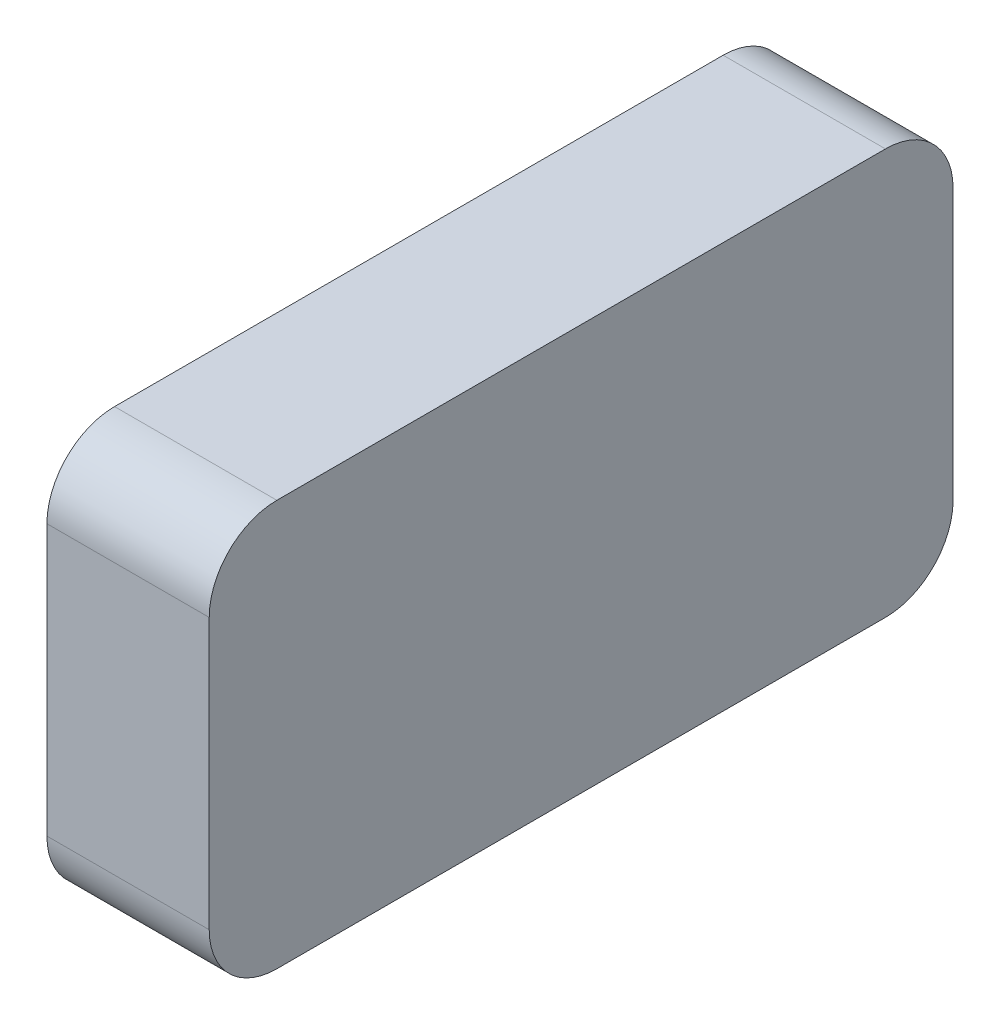
ISO-10303-21;
HEADER;
FILE_DESCRIPTION(('STEP AP214'),'2;1');
FILE_NAME('part.step','',(''),(''),'','','');
FILE_SCHEMA(('AUTOMOTIVE_DESIGN { 1 0 10303 214 1 1 1 1 }'));
ENDSEC;
DATA;
#1=APPLICATION_CONTEXT('core data for automotive mechanical design processes');
#2=APPLICATION_PROTOCOL_DEFINITION('international standard','automotive_design',2000,#1);
#3=PRODUCT_CONTEXT('',#1,'mechanical');
#4=PRODUCT('Part','Part','',(#3));
#5=PRODUCT_RELATED_PRODUCT_CATEGORY('part','',(#4));
#6=PRODUCT_DEFINITION_FORMATION('','',#4);
#7=PRODUCT_DEFINITION_CONTEXT('part definition',#1,'design');
#8=PRODUCT_DEFINITION('design','',#6,#7);
#9=PRODUCT_DEFINITION_SHAPE('','',#8);
#10=(LENGTH_UNIT() NAMED_UNIT(*) SI_UNIT(.MILLI.,.METRE.));
#11=(NAMED_UNIT(*) PLANE_ANGLE_UNIT() SI_UNIT($,.RADIAN.));
#12=(NAMED_UNIT(*) SI_UNIT($,.STERADIAN.) SOLID_ANGLE_UNIT());
#13=UNCERTAINTY_MEASURE_WITH_UNIT(LENGTH_MEASURE(1.E-05),#10,'distance_accuracy_value','');
#14=(GEOMETRIC_REPRESENTATION_CONTEXT(3) GLOBAL_UNCERTAINTY_ASSIGNED_CONTEXT((#13)) GLOBAL_UNIT_ASSIGNED_CONTEXT((#10,
#11,#12)) REPRESENTATION_CONTEXT('',''));
#15=CARTESIAN_POINT('',(0.,0.,0.));
#16=DIRECTION('',(0.,0.,1.));
#17=DIRECTION('',(1.,0.,0.));
#18=AXIS2_PLACEMENT_3D('',#15,#16,#17);
#19=CARTESIAN_POINT('',(12.,10.,-22.5));
#20=DIRECTION('',(-1.,0.,0.));
#21=DIRECTION('',(0.,0.,1.));
#22=AXIS2_PLACEMENT_3D('',#19,#20,#21);
#23=CYLINDRICAL_SURFACE('',#22,5.);
#24=CARTESIAN_POINT('',(0.,10.,-22.5));
#25=DIRECTION('',(1.,0.,0.));
#26=DIRECTION('',(0.,0.,1.));
#27=AXIS2_PLACEMENT_3D('',#24,#25,#26);
#28=CIRCLE('',#27,5.);
#29=CARTESIAN_POINT('',(0.,9.99999999999996,-27.5));
#30=VERTEX_POINT('',#29);
#31=CARTESIAN_POINT('',(0.,15.,-22.5));
#32=VERTEX_POINT('',#31);
#33=EDGE_CURVE('E137',#30,#32,#28,.T.);
#34=ORIENTED_EDGE('',*,*,#33,.T.);
#35=DIRECTION('',(-1.,0.,0.));
#36=VECTOR('',#35,1.);
#37=CARTESIAN_POINT('',(12.,15.,-22.5));
#38=LINE('',#37,#36);
#39=CARTESIAN_POINT('',(12.,15.,-22.5));
#40=VERTEX_POINT('',#39);
#41=EDGE_CURVE('E11',#40,#32,#38,.T.);
#42=ORIENTED_EDGE('',*,*,#41,.F.);
#43=CARTESIAN_POINT('',(12.,10.,-22.5));
#44=DIRECTION('',(1.,0.,0.));
#45=DIRECTION('',(0.,0.,1.));
#46=AXIS2_PLACEMENT_3D('',#43,#44,#45);
#47=CIRCLE('',#46,5.);
#48=CARTESIAN_POINT('',(12.,9.99999999999996,-27.5));
#49=VERTEX_POINT('',#48);
#50=EDGE_CURVE('E152',#49,#40,#47,.T.);
#51=ORIENTED_EDGE('',*,*,#50,.F.);
#52=DIRECTION('',(-1.,0.,0.));
#53=VECTOR('',#52,1.);
#54=CARTESIAN_POINT('',(12.,9.99999999999996,-27.5));
#55=LINE('',#54,#53);
#56=EDGE_CURVE('E133',#49,#30,#55,.T.);
#57=ORIENTED_EDGE('',*,*,#56,.T.);
#58=EDGE_LOOP('',(#34,#42,#51,#57));
#59=FACE_BOUND('',#58,.T.);
#60=ADVANCED_FACE('F36',(#59),#23,.T.);
#61=CARTESIAN_POINT('',(12.,15.,22.5));
#62=DIRECTION('',(0.,-1.,0.));
#63=DIRECTION('',(0.,0.,-1.));
#64=AXIS2_PLACEMENT_3D('',#61,#62,#63);
#65=PLANE('',#64);
#66=DIRECTION('',(0.,0.,1.));
#67=VECTOR('',#66,1.);
#68=CARTESIAN_POINT('',(0.,15.,22.5));
#69=LINE('',#68,#67);
#70=CARTESIAN_POINT('',(0.,15.,22.5));
#71=VERTEX_POINT('',#70);
#72=EDGE_CURVE('E140',#32,#71,#69,.T.);
#73=ORIENTED_EDGE('',*,*,#72,.T.);
#74=DIRECTION('',(-1.,0.,0.));
#75=VECTOR('',#74,1.);
#76=CARTESIAN_POINT('',(12.,15.,22.5));
#77=LINE('',#76,#75);
#78=CARTESIAN_POINT('',(12.,15.,22.5));
#79=VERTEX_POINT('',#78);
#80=EDGE_CURVE('E49',#79,#71,#77,.T.);
#81=ORIENTED_EDGE('',*,*,#80,.F.);
#82=DIRECTION('',(0.,0.,1.));
#83=VECTOR('',#82,1.);
#84=CARTESIAN_POINT('',(12.,15.,22.5));
#85=LINE('',#84,#83);
#86=EDGE_CURVE('E100',#40,#79,#85,.T.);
#87=ORIENTED_EDGE('',*,*,#86,.F.);
#88=ORIENTED_EDGE('',*,*,#41,.T.);
#89=EDGE_LOOP('',(#73,#81,#87,#88));
#90=FACE_BOUND('',#89,.T.);
#91=ADVANCED_FACE('F211',(#90),#65,.F.);
#92=CARTESIAN_POINT('',(12.,10.,22.5));
#93=DIRECTION('',(-1.,0.,0.));
#94=DIRECTION('',(0.,0.,1.));
#95=AXIS2_PLACEMENT_3D('',#92,#93,#94);
#96=CYLINDRICAL_SURFACE('',#95,5.);
#97=CARTESIAN_POINT('',(0.,10.,22.5));
#98=DIRECTION('',(1.,0.,0.));
#99=DIRECTION('',(0.,0.,1.));
#100=AXIS2_PLACEMENT_3D('',#97,#98,#99);
#101=CIRCLE('',#100,5.);
#102=CARTESIAN_POINT('',(0.,9.99999999999996,27.5));
#103=VERTEX_POINT('',#102);
#104=EDGE_CURVE('E143',#71,#103,#101,.T.);
#105=ORIENTED_EDGE('',*,*,#104,.T.);
#106=DIRECTION('',(-1.,0.,0.));
#107=VECTOR('',#106,1.);
#108=CARTESIAN_POINT('',(12.,9.99999999999996,27.5));
#109=LINE('',#108,#107);
#110=CARTESIAN_POINT('',(12.,9.99999999999996,27.5));
#111=VERTEX_POINT('',#110);
#112=EDGE_CURVE('E159',#111,#103,#109,.T.);
#113=ORIENTED_EDGE('',*,*,#112,.F.);
#114=CARTESIAN_POINT('',(12.,10.,22.5));
#115=DIRECTION('',(1.,0.,0.));
#116=DIRECTION('',(0.,0.,1.));
#117=AXIS2_PLACEMENT_3D('',#114,#115,#116);
#118=CIRCLE('',#117,5.);
#119=EDGE_CURVE('E168',#79,#111,#118,.T.);
#120=ORIENTED_EDGE('',*,*,#119,.F.);
#121=ORIENTED_EDGE('',*,*,#80,.T.);
#122=EDGE_LOOP('',(#105,#113,#120,#121));
#123=FACE_BOUND('',#122,.T.);
#124=ADVANCED_FACE('F166',(#123),#96,.T.);
#125=CARTESIAN_POINT('',(12.,9.99999999999996,27.5));
#126=DIRECTION('',(0.,0.,-1.));
#127=DIRECTION('',(0.,1.,0.));
#128=AXIS2_PLACEMENT_3D('',#125,#126,#127);
#129=PLANE('',#128);
#130=DIRECTION('',(0.,-1.,0.));
#131=VECTOR('',#130,1.);
#132=CARTESIAN_POINT('',(0.,9.99999999999996,27.5));
#133=LINE('',#132,#131);
#134=CARTESIAN_POINT('',(0.,-9.99999999999997,27.5));
#135=VERTEX_POINT('',#134);
#136=EDGE_CURVE('E145',#103,#135,#133,.T.);
#137=ORIENTED_EDGE('',*,*,#136,.T.);
#138=DIRECTION('',(-1.,0.,0.));
#139=VECTOR('',#138,1.);
#140=CARTESIAN_POINT('',(12.,-9.99999999999997,27.5));
#141=LINE('',#140,#139);
#142=CARTESIAN_POINT('',(12.,-9.99999999999997,27.5));
#143=VERTEX_POINT('',#142);
#144=EDGE_CURVE('E156',#143,#135,#141,.T.);
#145=ORIENTED_EDGE('',*,*,#144,.F.);
#146=DIRECTION('',(0.,-1.,0.));
#147=VECTOR('',#146,1.);
#148=CARTESIAN_POINT('',(12.,9.99999999999996,27.5));
#149=LINE('',#148,#147);
#150=EDGE_CURVE('E180',#111,#143,#149,.T.);
#151=ORIENTED_EDGE('',*,*,#150,.F.);
#152=ORIENTED_EDGE('',*,*,#112,.T.);
#153=EDGE_LOOP('',(#137,#145,#151,#152));
#154=FACE_BOUND('',#153,.T.);
#155=ADVANCED_FACE('F176',(#154),#129,.F.);
#156=CARTESIAN_POINT('',(12.,-10.,22.5));
#157=DIRECTION('',(-1.,0.,0.));
#158=DIRECTION('',(0.,0.,1.));
#159=AXIS2_PLACEMENT_3D('',#156,#157,#158);
#160=CYLINDRICAL_SURFACE('',#159,5.);
#161=CARTESIAN_POINT('',(0.,-10.,22.5));
#162=DIRECTION('',(1.,0.,0.));
#163=DIRECTION('',(0.,0.,1.));
#164=AXIS2_PLACEMENT_3D('',#161,#162,#163);
#165=CIRCLE('',#164,5.);
#166=CARTESIAN_POINT('',(0.,-15.,22.5));
#167=VERTEX_POINT('',#166);
#168=EDGE_CURVE('E147',#135,#167,#165,.T.);
#169=ORIENTED_EDGE('',*,*,#168,.T.);
#170=DIRECTION('',(-1.,0.,0.));
#171=VECTOR('',#170,1.);
#172=CARTESIAN_POINT('',(12.,-15.,22.5));
#173=LINE('',#172,#171);
#174=CARTESIAN_POINT('',(12.,-15.,22.5));
#175=VERTEX_POINT('',#174);
#176=EDGE_CURVE('E128',#175,#167,#173,.T.);
#177=ORIENTED_EDGE('',*,*,#176,.F.);
#178=CARTESIAN_POINT('',(12.,-10.,22.5));
#179=DIRECTION('',(1.,0.,0.));
#180=DIRECTION('',(0.,0.,1.));
#181=AXIS2_PLACEMENT_3D('',#178,#179,#180);
#182=CIRCLE('',#181,5.);
#183=EDGE_CURVE('E119',#143,#175,#182,.T.);
#184=ORIENTED_EDGE('',*,*,#183,.F.);
#185=ORIENTED_EDGE('',*,*,#144,.T.);
#186=EDGE_LOOP('',(#169,#177,#184,#185));
#187=FACE_BOUND('',#186,.T.);
#188=ADVANCED_FACE('F179',(#187),#160,.T.);
#189=CARTESIAN_POINT('',(12.,-15.,22.5));
#190=DIRECTION('',(0.,1.,0.));
#191=DIRECTION('',(0.,0.,1.));
#192=AXIS2_PLACEMENT_3D('',#189,#190,#191);
#193=PLANE('',#192);
#194=CARTESIAN_POINT('',(3.,-15.,0.));
#195=DIRECTION('',(0.,-1.,0.));
#196=DIRECTION('',(0.,0.,-1.));
#197=AXIS2_PLACEMENT_3D('',#194,#195,#196);
#198=CIRCLE('',#197,2.5);
#199=CARTESIAN_POINT('',(3.,-15.,-2.5));
#200=VERTEX_POINT('',#199);
#201=EDGE_CURVE('E191',#200,#200,#198,.T.);
#202=ORIENTED_EDGE('',*,*,#201,.F.);
#203=EDGE_LOOP('',(#202));
#204=FACE_BOUND('',#203,.T.);
#205=DIRECTION('',(0.,0.,-1.));
#206=VECTOR('',#205,1.);
#207=CARTESIAN_POINT('',(0.,-15.,22.5));
#208=LINE('',#207,#206);
#209=CARTESIAN_POINT('',(0.,-15.,-22.5));
#210=VERTEX_POINT('',#209);
#211=EDGE_CURVE('E127',#167,#210,#208,.T.);
#212=ORIENTED_EDGE('',*,*,#211,.T.);
#213=DIRECTION('',(-1.,0.,0.));
#214=VECTOR('',#213,1.);
#215=CARTESIAN_POINT('',(12.,-15.,-22.5));
#216=LINE('',#215,#214);
#217=CARTESIAN_POINT('',(12.,-15.,-22.5));
#218=VERTEX_POINT('',#217);
#219=EDGE_CURVE('E124',#218,#210,#216,.T.);
#220=ORIENTED_EDGE('',*,*,#219,.F.);
#221=DIRECTION('',(0.,0.,-1.));
#222=VECTOR('',#221,1.);
#223=CARTESIAN_POINT('',(12.,-15.,22.5));
#224=LINE('',#223,#222);
#225=EDGE_CURVE('E113',#175,#218,#224,.T.);
#226=ORIENTED_EDGE('',*,*,#225,.F.);
#227=ORIENTED_EDGE('',*,*,#176,.T.);
#228=EDGE_LOOP('',(#212,#220,#226,#227));
#229=FACE_BOUND('',#228,.T.);
#230=ADVANCED_FACE('F125',(#204,#229),#193,.F.);
#231=CARTESIAN_POINT('',(12.,-10.,-22.5));
#232=DIRECTION('',(-1.,0.,0.));
#233=DIRECTION('',(0.,0.,1.));
#234=AXIS2_PLACEMENT_3D('',#231,#232,#233);
#235=CYLINDRICAL_SURFACE('',#234,5.);
#236=CARTESIAN_POINT('',(0.,-10.,-22.5));
#237=DIRECTION('',(1.,0.,0.));
#238=DIRECTION('',(0.,0.,-1.));
#239=AXIS2_PLACEMENT_3D('',#236,#237,#238);
#240=CIRCLE('',#239,5.);
#241=CARTESIAN_POINT('',(0.,-9.99999999999997,-27.5));
#242=VERTEX_POINT('',#241);
#243=EDGE_CURVE('E86',#210,#242,#240,.T.);
#244=ORIENTED_EDGE('',*,*,#243,.T.);
#245=DIRECTION('',(-1.,0.,0.));
#246=VECTOR('',#245,1.);
#247=CARTESIAN_POINT('',(12.,-9.99999999999997,-27.5));
#248=LINE('',#247,#246);
#249=CARTESIAN_POINT('',(12.,-9.99999999999997,-27.5));
#250=VERTEX_POINT('',#249);
#251=EDGE_CURVE('E129',#250,#242,#248,.T.);
#252=ORIENTED_EDGE('',*,*,#251,.F.);
#253=CARTESIAN_POINT('',(12.,-10.,-22.5));
#254=DIRECTION('',(1.,0.,0.));
#255=DIRECTION('',(0.,0.,-1.));
#256=AXIS2_PLACEMENT_3D('',#253,#254,#255);
#257=CIRCLE('',#256,5.);
#258=EDGE_CURVE('E117',#218,#250,#257,.T.);
#259=ORIENTED_EDGE('',*,*,#258,.F.);
#260=ORIENTED_EDGE('',*,*,#219,.T.);
#261=EDGE_LOOP('',(#244,#252,#259,#260));
#262=FACE_BOUND('',#261,.T.);
#263=ADVANCED_FACE('F131',(#262),#235,.T.);
#264=CARTESIAN_POINT('',(12.,9.99999999999996,-27.5));
#265=DIRECTION('',(0.,0.,1.));
#266=DIRECTION('',(0.,-1.,0.));
#267=AXIS2_PLACEMENT_3D('',#264,#265,#266);
#268=PLANE('',#267);
#269=DIRECTION('',(0.,1.,0.));
#270=VECTOR('',#269,1.);
#271=CARTESIAN_POINT('',(0.,9.99999999999996,-27.5));
#272=LINE('',#271,#270);
#273=EDGE_CURVE('E92',#242,#30,#272,.T.);
#274=ORIENTED_EDGE('',*,*,#273,.T.);
#275=ORIENTED_EDGE('',*,*,#56,.F.);
#276=DIRECTION('',(0.,1.,0.));
#277=VECTOR('',#276,1.);
#278=CARTESIAN_POINT('',(12.,9.99999999999996,-27.5));
#279=LINE('',#278,#277);
#280=EDGE_CURVE('E57',#250,#49,#279,.T.);
#281=ORIENTED_EDGE('',*,*,#280,.F.);
#282=ORIENTED_EDGE('',*,*,#251,.T.);
#283=EDGE_LOOP('',(#274,#275,#281,#282));
#284=FACE_BOUND('',#283,.T.);
#285=ADVANCED_FACE('F218',(#284),#268,.F.);
#286=CARTESIAN_POINT('',(12.,10.,-22.5));
#287=DIRECTION('',(-1.,0.,0.));
#288=DIRECTION('',(0.,0.,1.));
#289=AXIS2_PLACEMENT_3D('',#286,#287,#288);
#290=PLANE('',#289);
#291=ORIENTED_EDGE('',*,*,#50,.T.);
#292=ORIENTED_EDGE('',*,*,#86,.T.);
#293=ORIENTED_EDGE('',*,*,#119,.T.);
#294=ORIENTED_EDGE('',*,*,#150,.T.);
#295=ORIENTED_EDGE('',*,*,#183,.T.);
#296=ORIENTED_EDGE('',*,*,#225,.T.);
#297=ORIENTED_EDGE('',*,*,#258,.T.);
#298=ORIENTED_EDGE('',*,*,#280,.T.);
#299=EDGE_LOOP('',(#291,#292,#293,#294,#295,#296,#297,#298));
#300=FACE_BOUND('',#299,.T.);
#301=ADVANCED_FACE('F115',(#300),#290,.F.);
#302=CARTESIAN_POINT('',(0.,10.,-22.5));
#303=DIRECTION('',(-1.,0.,0.));
#304=DIRECTION('',(0.,0.,1.));
#305=AXIS2_PLACEMENT_3D('',#302,#303,#304);
#306=PLANE('',#305);
#307=CARTESIAN_POINT('',(0.,0.,0.));
#308=DIRECTION('',(-1.,0.,0.));
#309=DIRECTION('',(0.,0.,1.));
#310=AXIS2_PLACEMENT_3D('',#307,#308,#309);
#311=CIRCLE('',#310,8.);
#312=CARTESIAN_POINT('',(0.,0.,8.));
#313=VERTEX_POINT('',#312);
#314=EDGE_CURVE('E186',#313,#313,#311,.T.);
#315=ORIENTED_EDGE('',*,*,#314,.F.);
#316=EDGE_LOOP('',(#315));
#317=FACE_BOUND('',#316,.T.);
#318=ORIENTED_EDGE('',*,*,#33,.F.);
#319=ORIENTED_EDGE('',*,*,#273,.F.);
#320=ORIENTED_EDGE('',*,*,#243,.F.);
#321=ORIENTED_EDGE('',*,*,#211,.F.);
#322=ORIENTED_EDGE('',*,*,#168,.F.);
#323=ORIENTED_EDGE('',*,*,#136,.F.);
#324=ORIENTED_EDGE('',*,*,#104,.F.);
#325=ORIENTED_EDGE('',*,*,#72,.F.);
#326=EDGE_LOOP('',(#318,#319,#320,#321,#322,#323,#324,#325));
#327=FACE_BOUND('',#326,.T.);
#328=ADVANCED_FACE('F172',(#317,#327),#306,.T.);
#329=CARTESIAN_POINT('',(8.,0.,0.));
#330=DIRECTION('',(-1.,0.,0.));
#331=DIRECTION('',(0.,0.,1.));
#332=AXIS2_PLACEMENT_3D('',#329,#330,#331);
#333=CYLINDRICAL_SURFACE('',#332,8.);
#334=CARTESIAN_POINT('',(3.,-7.59934207678533,-2.5));
#335=CARTESIAN_POINT('',(3.13669407221867,-7.59934291923872,-2.49999907560094));
#336=CARTESIAN_POINT('',(3.2733975374064,-7.60307063010085,-2.48875077582989));
#337=CARTESIAN_POINT('',(3.54278832175561,-7.61751277997754,-2.44418350802654));
#338=CARTESIAN_POINT('',(3.67547454546432,-7.62822910706272,-2.4108585756503));
#339=CARTESIAN_POINT('',(3.932889803864,-7.65531877671919,-2.32339576447118));
#340=CARTESIAN_POINT('',(4.05763246621136,-7.67168210388633,-2.26929471473354));
#341=CARTESIAN_POINT('',(4.29630539172803,-7.70820812437377,-2.14193828346314));
#342=CARTESIAN_POINT('',(4.41023373992025,-7.72837148871681,-2.06867951811264));
#343=CARTESIAN_POINT('',(4.62795773498697,-7.7710025533724,-1.90239214124458));
#344=CARTESIAN_POINT('',(4.73132721887197,-7.79352246769561,-1.80881879944079));
#345=CARTESIAN_POINT('',(4.92119202641837,-7.83788491720671,-1.60572409291099));
#346=CARTESIAN_POINT('',(5.00768499388969,-7.85972735745255,-1.49620050503713));
#347=CARTESIAN_POINT('',(5.16322212602249,-7.90087106780157,-1.26125182498672));
#348=CARTESIAN_POINT('',(5.23182740766291,-7.9201036912556,-1.13552311304019));
#349=CARTESIAN_POINT('',(5.3467520997111,-7.95325103666038,-0.873608465706806));
#350=CARTESIAN_POINT('',(5.39307674829917,-7.9671670083984,-0.737424996974102));
#351=CARTESIAN_POINT('',(5.46070225619414,-7.98774351641724,-0.462928713932195));
#352=CARTESIAN_POINT('',(5.4827314995757,-7.99461477968283,-0.324811430936431));
#353=CARTESIAN_POINT('',(5.50344869287505,-8.00107191752033,-0.0466816279690385));
#354=CARTESIAN_POINT('',(5.50214194871765,-8.00065944820141,0.0933304539461733));
#355=CARTESIAN_POINT('',(5.47670341682812,-7.99274232265063,0.366148960709463));
#356=CARTESIAN_POINT('',(5.453361232974,-7.98548301944274,0.499037268628066));
#357=CARTESIAN_POINT('',(5.38581001991396,-7.9649896512175,0.758906126695561));
#358=CARTESIAN_POINT('',(5.34159962982675,-7.95175519654419,0.885886290962471));
#359=CARTESIAN_POINT('',(5.23305962185038,-7.92046919458913,1.13215620630948));
#360=CARTESIAN_POINT('',(5.16849038287449,-7.90236067233341,1.25133281124536));
#361=CARTESIAN_POINT('',(5.02125780059032,-7.86323445907697,1.47740502230436));
#362=CARTESIAN_POINT('',(4.93858988172226,-7.84221603291309,1.58429751241882));
#363=CARTESIAN_POINT('',(4.75345273039957,-7.79847341467063,1.78747539690657));
#364=CARTESIAN_POINT('',(4.65030186232582,-7.77571463969686,1.88313309818382));
#365=CARTESIAN_POINT('',(4.42920979634286,-7.73181230889308,2.05597948519529));
#366=CARTESIAN_POINT('',(4.31126685881929,-7.71066894351396,2.13316599552377));
#367=CARTESIAN_POINT('',(4.06216506230485,-7.6722169326579,2.26760930038169));
#368=CARTESIAN_POINT('',(3.93087318201806,-7.65495380588194,2.32463361399527));
#369=CARTESIAN_POINT('',(3.65988101631599,-7.62675090557699,2.41556691891091));
#370=CARTESIAN_POINT('',(3.52018377161125,-7.61580886035023,2.44948421530003));
#371=CARTESIAN_POINT('',(3.24236009484572,-7.60199126814082,2.4920297037281));
#372=CARTESIAN_POINT('',(3.10439600752973,-7.59880932787513,2.50161908707794));
#373=CARTESIAN_POINT('',(2.82882051700972,-7.6000215491985,2.49793488996241));
#374=CARTESIAN_POINT('',(2.69120906260067,-7.60441454014633,2.48466484222813));
#375=CARTESIAN_POINT('',(2.42438340669515,-7.61997914967833,2.43649747026382));
#376=CARTESIAN_POINT('',(2.2950414518516,-7.63095108204023,2.40223662321101));
#377=CARTESIAN_POINT('',(2.04395641600833,-7.65822574662762,2.31380747322029));
#378=CARTESIAN_POINT('',(1.92221457815773,-7.67452934824623,2.25963592342302));
#379=CARTESIAN_POINT('',(1.68592178045638,-7.71121079306468,2.13115021311757));
#380=CARTESIAN_POINT('',(1.57167716881442,-7.73169206979509,2.05630294977117));
#381=CARTESIAN_POINT('',(1.3570193072762,-7.77420697945615,1.8892128173596));
#382=CARTESIAN_POINT('',(1.25660966214933,-7.79624101471394,1.79696542938156));
#383=CARTESIAN_POINT('',(1.06817926817436,-7.84048375125371,1.59314589550721));
#384=CARTESIAN_POINT('',(0.980844427720268,-7.86266184571362,1.48093129957704));
#385=CARTESIAN_POINT('',(0.826217913357491,-7.90378119687353,1.24290309130279));
#386=CARTESIAN_POINT('',(0.758925321377927,-7.92272260181891,1.11709010221724));
#387=CARTESIAN_POINT('',(0.646938875056638,-7.95512623857025,0.856211046663662));
#388=CARTESIAN_POINT('',(0.602081424312637,-7.968627991224,0.721220368567511));
#389=CARTESIAN_POINT('',(0.535854922820587,-7.98880485297152,0.445114508112778));
#390=CARTESIAN_POINT('',(0.514478521833009,-7.99548209828555,0.304001256680713));
#391=CARTESIAN_POINT('',(0.496417996500757,-8.00111606808923,0.0259698732977976));
#392=CARTESIAN_POINT('',(0.498743099658485,-8.0003825881478,-0.110878383893045));
#393=CARTESIAN_POINT('',(0.525623622097392,-7.99201956162097,-0.382146443846496));
#394=CARTESIAN_POINT('',(0.550177591983896,-7.98439046465238,-0.516566404359137));
#395=CARTESIAN_POINT('',(0.620188018444551,-7.96319141689591,-0.777510236961583));
#396=CARTESIAN_POINT('',(0.665379215690742,-7.9496969592041,-0.904111836898962));
#397=CARTESIAN_POINT('',(0.775141654416955,-7.918158911759,-1.14799685100018));
#398=CARTESIAN_POINT('',(0.839716219946858,-7.90011454182716,-1.26527866254896));
#399=CARTESIAN_POINT('',(0.988945516688878,-7.86059793766752,-1.49152338993938));
#400=CARTESIAN_POINT('',(1.07420704492795,-7.83903019501924,-1.60006921410622));
#401=CARTESIAN_POINT('',(1.26131977888693,-7.79517473094122,-1.80164158279864));
#402=CARTESIAN_POINT('',(1.36317594827877,-7.77288679569653,-1.89466346700832));
#403=CARTESIAN_POINT('',(1.5846314396822,-7.72923785154876,-2.06565731822505));
#404=CARTESIAN_POINT('',(1.70470680623315,-7.70793201726912,-2.14302855989422));
#405=CARTESIAN_POINT('',(1.95679624053828,-7.66960250559062,-2.27640941497043));
#406=CARTESIAN_POINT('',(2.0888054529005,-7.65257709722773,-2.33242766807092));
#407=CARTESIAN_POINT('',(2.34944523462934,-7.62613120880655,-2.41742360871585));
#408=CARTESIAN_POINT('',(2.47740509490313,-7.61618630087498,-2.44829879675747));
#409=CARTESIAN_POINT('',(2.73690766419298,-7.60279212964797,-2.48958491632199));
#410=CARTESIAN_POINT('',(2.868449482403,-7.59934126603196,-2.50000088961557));
#411=CARTESIAN_POINT('',(3.,-7.59934207678533,-2.5));
#412=B_SPLINE_CURVE_WITH_KNOTS('',3,(#334,#335,#336,#337,#338,#339,#340,#341,#342,#343,#344,
#345,#346,#347,#348,#349,#350,#351,#352,#353,#354,#355,#356,#357,#358,#359,#360,#361,#362,#363,
#364,#365,#366,#367,#368,#369,#370,#371,#372,#373,#374,#375,#376,#377,#378,#379,#380,#381,#382,
#383,#384,#385,#386,#387,#388,#389,#390,#391,#392,#393,#394,#395,#396,#397,#398,#399,#400,#401,
#402,#403,#404,#405,#406,#407,#408,#409,#410,#411),.UNSPECIFIED.,.T.,.F.,(4,2,2,2,2,2,2,2,2,2,2,
2,2,2,2,2,2,2,2,2,2,2,2,2,2,2,2,2,2,2,2,2,2,2,2,2,2,2,4),(0.,0.409596275096981,
0.819303254119471,1.22828728823716,1.6373436098499,2.05914161101677,2.48099845882245,
2.91239643927466,3.34369294835844,3.76167445671067,4.17956092943549,4.58301965939501,
4.98650470380186,5.39492809216818,5.80345485426375,6.22900677874668,6.65460879707552,
7.08496941871144,7.51517527910369,7.92809866580735,8.34095824443043,8.7418794409359,
9.14286604511284,9.55535226624085,9.96794576028624,10.3976387562789,10.8273120663904,
11.2538047858686,11.6801639628603,12.0887760488391,12.4973614938948,12.9008369303438,
13.3043815982817,13.7216138621529,14.1389711554924,14.5701559100827,15.0011660161251,
15.3954470874764,15.7896309838242),.UNSPECIFIED.);
#413=CARTESIAN_POINT('',(3.,-7.59934207678533,-2.5));
#414=VERTEX_POINT('',#413);
#415=EDGE_CURVE('E39',#414,#414,#412,.T.);
#416=ORIENTED_EDGE('',*,*,#415,.T.);
#417=EDGE_LOOP('',(#416));
#418=FACE_BOUND('',#417,.T.);
#419=CARTESIAN_POINT('',(8.,0.,0.));
#420=DIRECTION('',(-1.,0.,0.));
#421=DIRECTION('',(0.,0.,1.));
#422=AXIS2_PLACEMENT_3D('',#419,#420,#421);
#423=CIRCLE('',#422,8.);
#424=CARTESIAN_POINT('',(8.,0.,8.));
#425=VERTEX_POINT('',#424);
#426=EDGE_CURVE('E141',#425,#425,#423,.T.);
#427=ORIENTED_EDGE('',*,*,#426,.F.);
#428=EDGE_LOOP('',(#427));
#429=FACE_BOUND('',#428,.T.);
#430=ORIENTED_EDGE('',*,*,#314,.T.);
#431=EDGE_LOOP('',(#430));
#432=FACE_BOUND('',#431,.T.);
#433=ADVANCED_FACE('F198',(#418,#429,#432),#333,.F.);
#434=CARTESIAN_POINT('',(8.,0.,0.));
#435=DIRECTION('',(-1.,0.,0.));
#436=DIRECTION('',(0.,0.,1.));
#437=AXIS2_PLACEMENT_3D('',#434,#435,#436);
#438=PLANE('',#437);
#439=ORIENTED_EDGE('',*,*,#426,.T.);
#440=EDGE_LOOP('',(#439));
#441=FACE_BOUND('',#440,.T.);
#442=ADVANCED_FACE('F203',(#441),#438,.T.);
#443=CARTESIAN_POINT('',(3.,-5.,0.));
#444=DIRECTION('',(0.,-1.,0.));
#445=DIRECTION('',(0.,0.,-1.));
#446=AXIS2_PLACEMENT_3D('',#443,#444,#445);
#447=CYLINDRICAL_SURFACE('',#446,2.5);
#448=ORIENTED_EDGE('',*,*,#201,.T.);
#449=EDGE_LOOP('',(#448));
#450=FACE_BOUND('',#449,.T.);
#451=ORIENTED_EDGE('',*,*,#415,.F.);
#452=EDGE_LOOP('',(#451));
#453=FACE_BOUND('',#452,.T.);
#454=ADVANCED_FACE('F201',(#450,#453),#447,.F.);
#455=CLOSED_SHELL('',(#60,#91,#124,#155,#188,#230,#263,#285,#301,#328,#433,#442,#454));
#456=MANIFOLD_SOLID_BREP('B2',#455);
#457=ADVANCED_BREP_SHAPE_REPRESENTATION('',(#18,#456),#14);
#458=SHAPE_DEFINITION_REPRESENTATION(#9,#457);
ENDSEC;
END-ISO-10303-21;
